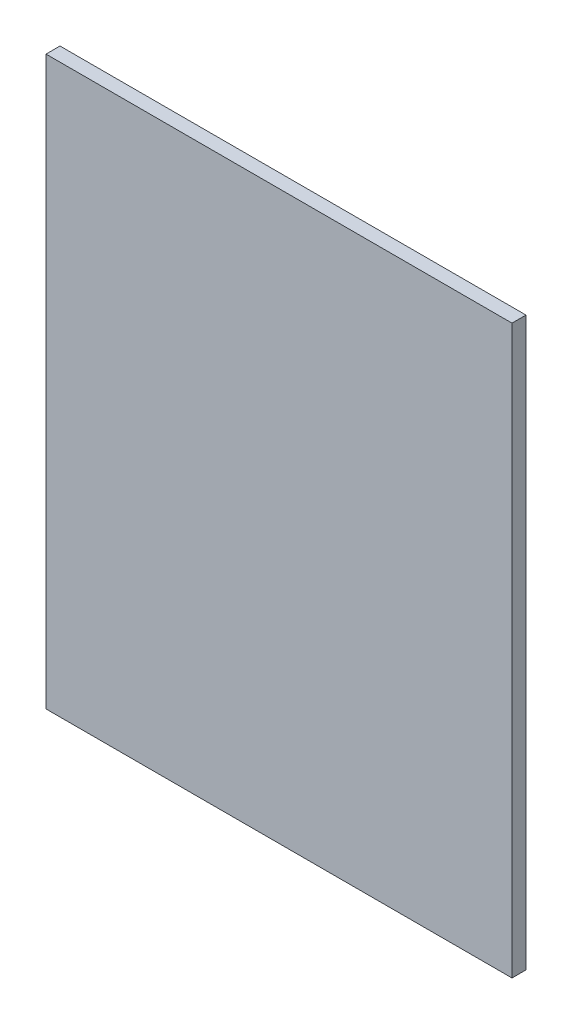
ISO-10303-21;
HEADER;
FILE_DESCRIPTION(('STEP AP214'),'2;1');
FILE_NAME('part.step','',(''),(''),'','','');
FILE_SCHEMA(('AUTOMOTIVE_DESIGN { 1 0 10303 214 1 1 1 1 }'));
ENDSEC;
DATA;
#1=APPLICATION_CONTEXT('core data for automotive mechanical design processes');
#2=APPLICATION_PROTOCOL_DEFINITION('international standard','automotive_design',2000,#1);
#3=PRODUCT_CONTEXT('',#1,'mechanical');
#4=PRODUCT('Part','Part','',(#3));
#5=PRODUCT_RELATED_PRODUCT_CATEGORY('part','',(#4));
#6=PRODUCT_DEFINITION_FORMATION('','',#4);
#7=PRODUCT_DEFINITION_CONTEXT('part definition',#1,'design');
#8=PRODUCT_DEFINITION('design','',#6,#7);
#9=PRODUCT_DEFINITION_SHAPE('','',#8);
#10=(LENGTH_UNIT() NAMED_UNIT(*) SI_UNIT(.MILLI.,.METRE.));
#11=(NAMED_UNIT(*) PLANE_ANGLE_UNIT() SI_UNIT($,.RADIAN.));
#12=(NAMED_UNIT(*) SI_UNIT($,.STERADIAN.) SOLID_ANGLE_UNIT());
#13=UNCERTAINTY_MEASURE_WITH_UNIT(LENGTH_MEASURE(1.E-05),#10,'distance_accuracy_value','');
#14=(GEOMETRIC_REPRESENTATION_CONTEXT(3) GLOBAL_UNCERTAINTY_ASSIGNED_CONTEXT((#13)) GLOBAL_UNIT_ASSIGNED_CONTEXT((#10,
#11,#12)) REPRESENTATION_CONTEXT('',''));
#15=CARTESIAN_POINT('',(0.,0.,0.));
#16=DIRECTION('',(0.,0.,1.));
#17=DIRECTION('',(1.,0.,0.));
#18=AXIS2_PLACEMENT_3D('',#15,#16,#17);
#19=CARTESIAN_POINT('',(-557.5,678.5,33.45));
#20=DIRECTION('',(1.,0.,0.));
#21=DIRECTION('',(0.,1.,0.));
#22=AXIS2_PLACEMENT_3D('',#19,#20,#21);
#23=PLANE('',#22);
#24=DIRECTION('',(0.,-1.,0.));
#25=VECTOR('',#24,1.);
#26=CARTESIAN_POINT('',(-557.5,678.5,0.));
#27=LINE('',#26,#25);
#28=CARTESIAN_POINT('',(-557.5,678.5,0.));
#29=VERTEX_POINT('',#28);
#30=CARTESIAN_POINT('',(-557.5,-678.5,0.));
#31=VERTEX_POINT('',#30);
#32=EDGE_CURVE('E113',#29,#31,#27,.T.);
#33=ORIENTED_EDGE('',*,*,#32,.T.);
#34=DIRECTION('',(0.,0.,-1.));
#35=VECTOR('',#34,1.);
#36=CARTESIAN_POINT('',(-557.5,-678.5,33.45));
#37=LINE('',#36,#35);
#38=CARTESIAN_POINT('',(-557.5,-678.5,33.45));
#39=VERTEX_POINT('',#38);
#40=EDGE_CURVE('E11',#39,#31,#37,.T.);
#41=ORIENTED_EDGE('',*,*,#40,.F.);
#42=DIRECTION('',(0.,-1.,0.));
#43=VECTOR('',#42,1.);
#44=CARTESIAN_POINT('',(-557.5,678.5,33.45));
#45=LINE('',#44,#43);
#46=CARTESIAN_POINT('',(-557.5,678.5,33.45));
#47=VERTEX_POINT('',#46);
#48=EDGE_CURVE('E97',#47,#39,#45,.T.);
#49=ORIENTED_EDGE('',*,*,#48,.F.);
#50=DIRECTION('',(0.,0.,-1.));
#51=VECTOR('',#50,1.);
#52=CARTESIAN_POINT('',(-557.5,678.5,33.45));
#53=LINE('',#52,#51);
#54=EDGE_CURVE('E109',#47,#29,#53,.T.);
#55=ORIENTED_EDGE('',*,*,#54,.T.);
#56=EDGE_LOOP('',(#33,#41,#49,#55));
#57=FACE_BOUND('',#56,.T.);
#58=ADVANCED_FACE('F45',(#57),#23,.F.);
#59=CARTESIAN_POINT('',(557.5,-678.5,33.45));
#60=DIRECTION('',(0.,1.,0.));
#61=DIRECTION('',(-1.,0.,0.));
#62=AXIS2_PLACEMENT_3D('',#59,#60,#61);
#63=PLANE('',#62);
#64=DIRECTION('',(1.,0.,0.));
#65=VECTOR('',#64,1.);
#66=CARTESIAN_POINT('',(557.5,-678.5,0.));
#67=LINE('',#66,#65);
#68=CARTESIAN_POINT('',(557.5,-678.5,0.));
#69=VERTEX_POINT('',#68);
#70=EDGE_CURVE('E102',#31,#69,#67,.T.);
#71=ORIENTED_EDGE('',*,*,#70,.T.);
#72=DIRECTION('',(0.,0.,-1.));
#73=VECTOR('',#72,1.);
#74=CARTESIAN_POINT('',(557.5,-678.5,33.45));
#75=LINE('',#74,#73);
#76=CARTESIAN_POINT('',(557.5,-678.5,33.45));
#77=VERTEX_POINT('',#76);
#78=EDGE_CURVE('E54',#77,#69,#75,.T.);
#79=ORIENTED_EDGE('',*,*,#78,.F.);
#80=DIRECTION('',(1.,0.,0.));
#81=VECTOR('',#80,1.);
#82=CARTESIAN_POINT('',(557.5,-678.5,33.45));
#83=LINE('',#82,#81);
#84=EDGE_CURVE('E92',#39,#77,#83,.T.);
#85=ORIENTED_EDGE('',*,*,#84,.F.);
#86=ORIENTED_EDGE('',*,*,#40,.T.);
#87=EDGE_LOOP('',(#71,#79,#85,#86));
#88=FACE_BOUND('',#87,.T.);
#89=ADVANCED_FACE('F101',(#88),#63,.F.);
#90=CARTESIAN_POINT('',(557.5,678.5,33.45));
#91=DIRECTION('',(-1.,0.,0.));
#92=DIRECTION('',(0.,-1.,0.));
#93=AXIS2_PLACEMENT_3D('',#90,#91,#92);
#94=PLANE('',#93);
#95=DIRECTION('',(0.,1.,0.));
#96=VECTOR('',#95,1.);
#97=CARTESIAN_POINT('',(557.5,678.5,0.));
#98=LINE('',#97,#96);
#99=CARTESIAN_POINT('',(557.5,678.5,0.));
#100=VERTEX_POINT('',#99);
#101=EDGE_CURVE('E79',#69,#100,#98,.T.);
#102=ORIENTED_EDGE('',*,*,#101,.T.);
#103=DIRECTION('',(0.,0.,-1.));
#104=VECTOR('',#103,1.);
#105=CARTESIAN_POINT('',(557.5,678.5,33.45));
#106=LINE('',#105,#104);
#107=CARTESIAN_POINT('',(557.5,678.5,33.45));
#108=VERTEX_POINT('',#107);
#109=EDGE_CURVE('E104',#108,#100,#106,.T.);
#110=ORIENTED_EDGE('',*,*,#109,.F.);
#111=DIRECTION('',(0.,1.,0.));
#112=VECTOR('',#111,1.);
#113=CARTESIAN_POINT('',(557.5,678.5,33.45));
#114=LINE('',#113,#112);
#115=EDGE_CURVE('E95',#77,#108,#114,.T.);
#116=ORIENTED_EDGE('',*,*,#115,.F.);
#117=ORIENTED_EDGE('',*,*,#78,.T.);
#118=EDGE_LOOP('',(#102,#110,#116,#117));
#119=FACE_BOUND('',#118,.T.);
#120=ADVANCED_FACE('F105',(#119),#94,.F.);
#121=CARTESIAN_POINT('',(557.5,678.5,33.45));
#122=DIRECTION('',(0.,-1.,0.));
#123=DIRECTION('',(0.,0.,-1.));
#124=AXIS2_PLACEMENT_3D('',#121,#122,#123);
#125=PLANE('',#124);
#126=DIRECTION('',(-1.,0.,0.));
#127=VECTOR('',#126,1.);
#128=CARTESIAN_POINT('',(557.5,678.5,0.));
#129=LINE('',#128,#127);
#130=EDGE_CURVE('E85',#100,#29,#129,.T.);
#131=ORIENTED_EDGE('',*,*,#130,.T.);
#132=ORIENTED_EDGE('',*,*,#54,.F.);
#133=DIRECTION('',(-1.,0.,0.));
#134=VECTOR('',#133,1.);
#135=CARTESIAN_POINT('',(557.5,678.5,33.45));
#136=LINE('',#135,#134);
#137=EDGE_CURVE('E62',#108,#47,#136,.T.);
#138=ORIENTED_EDGE('',*,*,#137,.F.);
#139=ORIENTED_EDGE('',*,*,#109,.T.);
#140=EDGE_LOOP('',(#131,#132,#138,#139));
#141=FACE_BOUND('',#140,.T.);
#142=ADVANCED_FACE('F126',(#141),#125,.F.);
#143=CARTESIAN_POINT('',(0.,0.,33.45));
#144=DIRECTION('',(0.,0.,-1.));
#145=DIRECTION('',(-1.,0.,0.));
#146=AXIS2_PLACEMENT_3D('',#143,#144,#145);
#147=PLANE('',#146);
#148=ORIENTED_EDGE('',*,*,#48,.T.);
#149=ORIENTED_EDGE('',*,*,#84,.T.);
#150=ORIENTED_EDGE('',*,*,#115,.T.);
#151=ORIENTED_EDGE('',*,*,#137,.T.);
#152=EDGE_LOOP('',(#148,#149,#150,#151));
#153=FACE_BOUND('',#152,.T.);
#154=ADVANCED_FACE('F93',(#153),#147,.F.);
#155=CARTESIAN_POINT('',(0.,0.,0.));
#156=DIRECTION('',(0.,0.,-1.));
#157=DIRECTION('',(-1.,0.,0.));
#158=AXIS2_PLACEMENT_3D('',#155,#156,#157);
#159=PLANE('',#158);
#160=ORIENTED_EDGE('',*,*,#32,.F.);
#161=ORIENTED_EDGE('',*,*,#130,.F.);
#162=ORIENTED_EDGE('',*,*,#101,.F.);
#163=ORIENTED_EDGE('',*,*,#70,.F.);
#164=EDGE_LOOP('',(#160,#161,#162,#163));
#165=FACE_BOUND('',#164,.T.);
#166=ADVANCED_FACE('F129',(#165),#159,.T.);
#167=CLOSED_SHELL('',(#58,#89,#120,#142,#154,#166));
#168=MANIFOLD_SOLID_BREP('B2',#167);
#169=ADVANCED_BREP_SHAPE_REPRESENTATION('',(#18,#168),#14);
#170=SHAPE_DEFINITION_REPRESENTATION(#9,#169);
ENDSEC;
END-ISO-10303-21;
